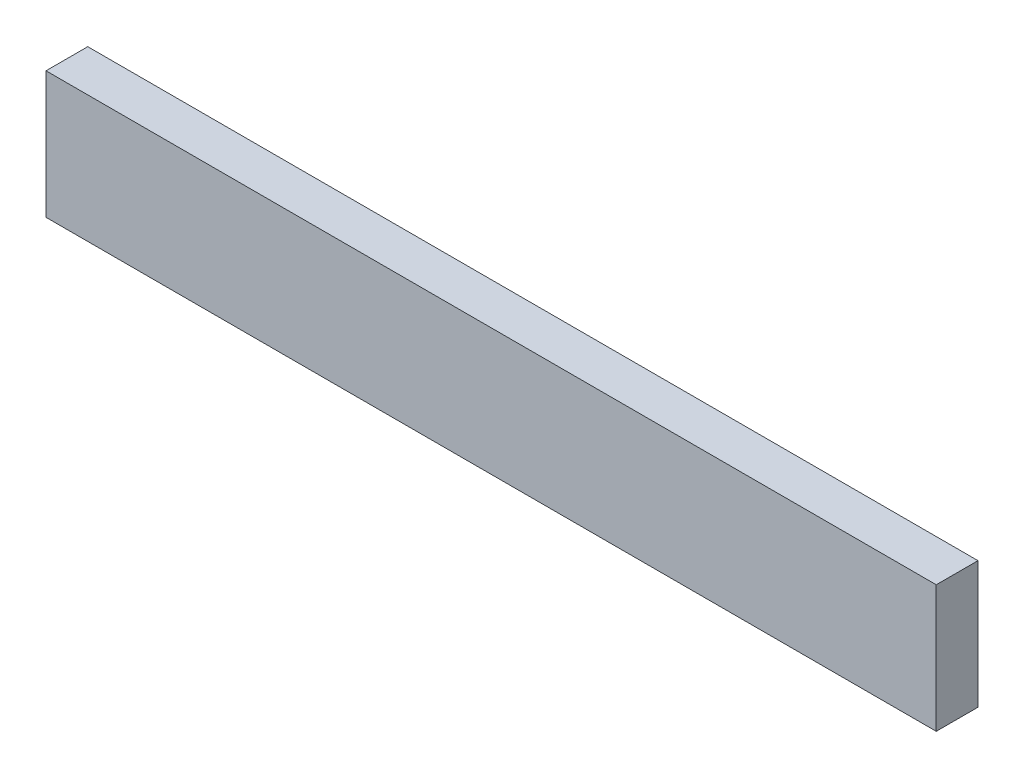
ISO-10303-21;
HEADER;
FILE_DESCRIPTION(('STEP AP214'),'2;1');
FILE_NAME('part.step','',(''),(''),'','','');
FILE_SCHEMA(('AUTOMOTIVE_DESIGN { 1 0 10303 214 1 1 1 1 }'));
ENDSEC;
DATA;
#1=APPLICATION_CONTEXT('core data for automotive mechanical design processes');
#2=APPLICATION_PROTOCOL_DEFINITION('international standard','automotive_design',2000,#1);
#3=PRODUCT_CONTEXT('',#1,'mechanical');
#4=PRODUCT('Part','Part','',(#3));
#5=PRODUCT_RELATED_PRODUCT_CATEGORY('part','',(#4));
#6=PRODUCT_DEFINITION_FORMATION('','',#4);
#7=PRODUCT_DEFINITION_CONTEXT('part definition',#1,'design');
#8=PRODUCT_DEFINITION('design','',#6,#7);
#9=PRODUCT_DEFINITION_SHAPE('','',#8);
#10=(LENGTH_UNIT() NAMED_UNIT(*) SI_UNIT(.MILLI.,.METRE.));
#11=(NAMED_UNIT(*) PLANE_ANGLE_UNIT() SI_UNIT($,.RADIAN.));
#12=(NAMED_UNIT(*) SI_UNIT($,.STERADIAN.) SOLID_ANGLE_UNIT());
#13=UNCERTAINTY_MEASURE_WITH_UNIT(LENGTH_MEASURE(1.E-05),#10,'distance_accuracy_value','');
#14=(GEOMETRIC_REPRESENTATION_CONTEXT(3) GLOBAL_UNCERTAINTY_ASSIGNED_CONTEXT((#13)) GLOBAL_UNIT_ASSIGNED_CONTEXT((#10,
#11,#12)) REPRESENTATION_CONTEXT('',''));
#15=CARTESIAN_POINT('',(0.,0.,0.));
#16=DIRECTION('',(0.,0.,1.));
#17=DIRECTION('',(1.,0.,0.));
#18=AXIS2_PLACEMENT_3D('',#15,#16,#17);
#19=CARTESIAN_POINT('',(533.,76.,50.));
#20=DIRECTION('',(-1.,0.,0.));
#21=DIRECTION('',(0.,0.,1.));
#22=AXIS2_PLACEMENT_3D('',#19,#20,#21);
#23=PLANE('',#22);
#24=DIRECTION('',(0.,1.,0.));
#25=VECTOR('',#24,1.);
#26=CARTESIAN_POINT('',(533.,76.,0.));
#27=LINE('',#26,#25);
#28=CARTESIAN_POINT('',(533.,-76.,0.));
#29=VERTEX_POINT('',#28);
#30=CARTESIAN_POINT('',(533.,76.,0.));
#31=VERTEX_POINT('',#30);
#32=EDGE_CURVE('E100',#29,#31,#27,.T.);
#33=ORIENTED_EDGE('',*,*,#32,.T.);
#34=DIRECTION('',(0.,0.,-1.));
#35=VECTOR('',#34,1.);
#36=CARTESIAN_POINT('',(533.,76.,50.));
#37=LINE('',#36,#35);
#38=CARTESIAN_POINT('',(533.,76.,50.));
#39=VERTEX_POINT('',#38);
#40=EDGE_CURVE('E11',#39,#31,#37,.T.);
#41=ORIENTED_EDGE('',*,*,#40,.F.);
#42=DIRECTION('',(0.,1.,0.));
#43=VECTOR('',#42,1.);
#44=CARTESIAN_POINT('',(533.,76.,50.));
#45=LINE('',#44,#43);
#46=CARTESIAN_POINT('',(533.,-76.,50.));
#47=VERTEX_POINT('',#46);
#48=EDGE_CURVE('E88',#47,#39,#45,.T.);
#49=ORIENTED_EDGE('',*,*,#48,.F.);
#50=DIRECTION('',(0.,0.,-1.));
#51=VECTOR('',#50,1.);
#52=CARTESIAN_POINT('',(533.,-76.,50.));
#53=LINE('',#52,#51);
#54=EDGE_CURVE('E96',#47,#29,#53,.T.);
#55=ORIENTED_EDGE('',*,*,#54,.T.);
#56=EDGE_LOOP('',(#33,#41,#49,#55));
#57=FACE_BOUND('',#56,.T.);
#58=ADVANCED_FACE('F37',(#57),#23,.F.);
#59=CARTESIAN_POINT('',(-533.,76.,50.));
#60=DIRECTION('',(0.,-1.,0.));
#61=DIRECTION('',(0.,0.,-1.));
#62=AXIS2_PLACEMENT_3D('',#59,#60,#61);
#63=PLANE('',#62);
#64=DIRECTION('',(-1.,0.,0.));
#65=VECTOR('',#64,1.);
#66=CARTESIAN_POINT('',(-533.,76.,0.));
#67=LINE('',#66,#65);
#68=CARTESIAN_POINT('',(-533.,76.,0.));
#69=VERTEX_POINT('',#68);
#70=EDGE_CURVE('E92',#31,#69,#67,.T.);
#71=ORIENTED_EDGE('',*,*,#70,.T.);
#72=DIRECTION('',(0.,0.,-1.));
#73=VECTOR('',#72,1.);
#74=CARTESIAN_POINT('',(-533.,76.,50.));
#75=LINE('',#74,#73);
#76=CARTESIAN_POINT('',(-533.,76.,50.));
#77=VERTEX_POINT('',#76);
#78=EDGE_CURVE('E45',#77,#69,#75,.T.);
#79=ORIENTED_EDGE('',*,*,#78,.F.);
#80=DIRECTION('',(-1.,0.,0.));
#81=VECTOR('',#80,1.);
#82=CARTESIAN_POINT('',(-533.,76.,50.));
#83=LINE('',#82,#81);
#84=EDGE_CURVE('E83',#39,#77,#83,.T.);
#85=ORIENTED_EDGE('',*,*,#84,.F.);
#86=ORIENTED_EDGE('',*,*,#40,.T.);
#87=EDGE_LOOP('',(#71,#79,#85,#86));
#88=FACE_BOUND('',#87,.T.);
#89=ADVANCED_FACE('F91',(#88),#63,.F.);
#90=CARTESIAN_POINT('',(-533.,76.,50.));
#91=DIRECTION('',(1.,0.,0.));
#92=DIRECTION('',(0.,0.,-1.));
#93=AXIS2_PLACEMENT_3D('',#90,#91,#92);
#94=PLANE('',#93);
#95=DIRECTION('',(0.,-1.,0.));
#96=VECTOR('',#95,1.);
#97=CARTESIAN_POINT('',(-533.,76.,0.));
#98=LINE('',#97,#96);
#99=CARTESIAN_POINT('',(-533.,-76.,0.));
#100=VERTEX_POINT('',#99);
#101=EDGE_CURVE('E70',#69,#100,#98,.T.);
#102=ORIENTED_EDGE('',*,*,#101,.T.);
#103=DIRECTION('',(0.,0.,-1.));
#104=VECTOR('',#103,1.);
#105=CARTESIAN_POINT('',(-533.,-76.,50.));
#106=LINE('',#105,#104);
#107=CARTESIAN_POINT('',(-533.,-76.,50.));
#108=VERTEX_POINT('',#107);
#109=EDGE_CURVE('E93',#108,#100,#106,.T.);
#110=ORIENTED_EDGE('',*,*,#109,.F.);
#111=DIRECTION('',(0.,-1.,0.));
#112=VECTOR('',#111,1.);
#113=CARTESIAN_POINT('',(-533.,76.,50.));
#114=LINE('',#113,#112);
#115=EDGE_CURVE('E86',#77,#108,#114,.T.);
#116=ORIENTED_EDGE('',*,*,#115,.F.);
#117=ORIENTED_EDGE('',*,*,#78,.T.);
#118=EDGE_LOOP('',(#102,#110,#116,#117));
#119=FACE_BOUND('',#118,.T.);
#120=ADVANCED_FACE('F94',(#119),#94,.F.);
#121=CARTESIAN_POINT('',(-533.,-76.,50.));
#122=DIRECTION('',(0.,1.,0.));
#123=DIRECTION('',(0.,0.,1.));
#124=AXIS2_PLACEMENT_3D('',#121,#122,#123);
#125=PLANE('',#124);
#126=DIRECTION('',(1.,0.,0.));
#127=VECTOR('',#126,1.);
#128=CARTESIAN_POINT('',(-533.,-76.,0.));
#129=LINE('',#128,#127);
#130=EDGE_CURVE('E76',#100,#29,#129,.T.);
#131=ORIENTED_EDGE('',*,*,#130,.T.);
#132=ORIENTED_EDGE('',*,*,#54,.F.);
#133=DIRECTION('',(1.,0.,0.));
#134=VECTOR('',#133,1.);
#135=CARTESIAN_POINT('',(-533.,-76.,50.));
#136=LINE('',#135,#134);
#137=EDGE_CURVE('E53',#108,#47,#136,.T.);
#138=ORIENTED_EDGE('',*,*,#137,.F.);
#139=ORIENTED_EDGE('',*,*,#109,.T.);
#140=EDGE_LOOP('',(#131,#132,#138,#139));
#141=FACE_BOUND('',#140,.T.);
#142=ADVANCED_FACE('F107',(#141),#125,.F.);
#143=CARTESIAN_POINT('',(0.,0.,50.));
#144=DIRECTION('',(0.,0.,1.));
#145=DIRECTION('',(1.,0.,0.));
#146=AXIS2_PLACEMENT_3D('',#143,#144,#145);
#147=PLANE('',#146);
#148=ORIENTED_EDGE('',*,*,#48,.T.);
#149=ORIENTED_EDGE('',*,*,#84,.T.);
#150=ORIENTED_EDGE('',*,*,#115,.T.);
#151=ORIENTED_EDGE('',*,*,#137,.T.);
#152=EDGE_LOOP('',(#148,#149,#150,#151));
#153=FACE_BOUND('',#152,.T.);
#154=ADVANCED_FACE('F84',(#153),#147,.T.);
#155=CARTESIAN_POINT('',(0.,0.,0.));
#156=DIRECTION('',(0.,0.,1.));
#157=DIRECTION('',(1.,0.,0.));
#158=AXIS2_PLACEMENT_3D('',#155,#156,#157);
#159=PLANE('',#158);
#160=ORIENTED_EDGE('',*,*,#32,.F.);
#161=ORIENTED_EDGE('',*,*,#130,.F.);
#162=ORIENTED_EDGE('',*,*,#101,.F.);
#163=ORIENTED_EDGE('',*,*,#70,.F.);
#164=EDGE_LOOP('',(#160,#161,#162,#163));
#165=FACE_BOUND('',#164,.T.);
#166=ADVANCED_FACE('F110',(#165),#159,.F.);
#167=CLOSED_SHELL('',(#58,#89,#120,#142,#154,#166));
#168=MANIFOLD_SOLID_BREP('B2',#167);
#169=ADVANCED_BREP_SHAPE_REPRESENTATION('',(#18,#168),#14);
#170=SHAPE_DEFINITION_REPRESENTATION(#9,#169);
ENDSEC;
END-ISO-10303-21;
